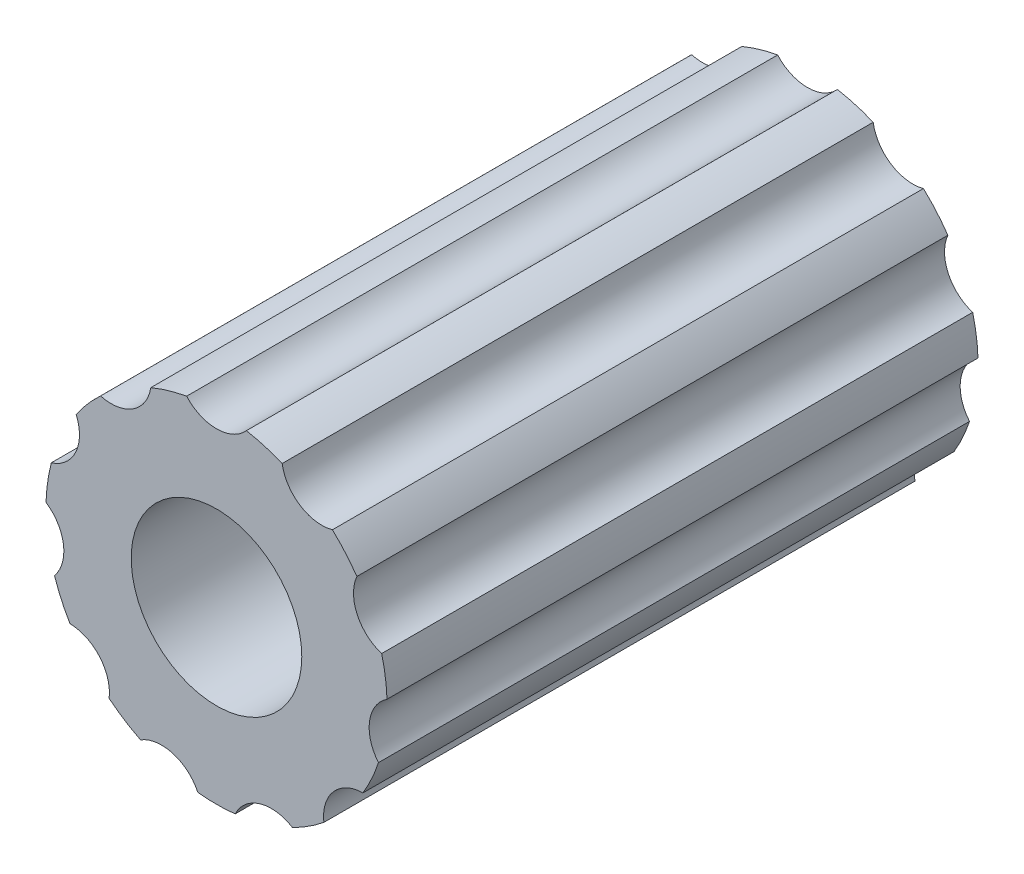
ISO-10303-21;
HEADER;
FILE_DESCRIPTION(('STEP AP214'),'2;1');
FILE_NAME('part.step','',(''),(''),'','','');
FILE_SCHEMA(('AUTOMOTIVE_DESIGN { 1 0 10303 214 1 1 1 1 }'));
ENDSEC;
DATA;
#1=APPLICATION_CONTEXT('core data for automotive mechanical design processes');
#2=APPLICATION_PROTOCOL_DEFINITION('international standard','automotive_design',2000,#1);
#3=PRODUCT_CONTEXT('',#1,'mechanical');
#4=PRODUCT('Part','Part','',(#3));
#5=PRODUCT_RELATED_PRODUCT_CATEGORY('part','',(#4));
#6=PRODUCT_DEFINITION_FORMATION('','',#4);
#7=PRODUCT_DEFINITION_CONTEXT('part definition',#1,'design');
#8=PRODUCT_DEFINITION('design','',#6,#7);
#9=PRODUCT_DEFINITION_SHAPE('','',#8);
#10=(LENGTH_UNIT() NAMED_UNIT(*) SI_UNIT(.MILLI.,.METRE.));
#11=(NAMED_UNIT(*) PLANE_ANGLE_UNIT() SI_UNIT($,.RADIAN.));
#12=(NAMED_UNIT(*) SI_UNIT($,.STERADIAN.) SOLID_ANGLE_UNIT());
#13=UNCERTAINTY_MEASURE_WITH_UNIT(LENGTH_MEASURE(1.E-05),#10,'distance_accuracy_value','');
#14=(GEOMETRIC_REPRESENTATION_CONTEXT(3) GLOBAL_UNCERTAINTY_ASSIGNED_CONTEXT((#13)) GLOBAL_UNIT_ASSIGNED_CONTEXT((#10,
#11,#12)) REPRESENTATION_CONTEXT('',''));
#15=CARTESIAN_POINT('',(0.,0.,0.));
#16=DIRECTION('',(0.,0.,1.));
#17=DIRECTION('',(1.,0.,0.));
#18=AXIS2_PLACEMENT_3D('',#15,#16,#17);
#19=CARTESIAN_POINT('',(0.,0.,22.));
#20=DIRECTION('',(0.,0.,-1.));
#21=DIRECTION('',(-1.,0.,0.));
#22=AXIS2_PLACEMENT_3D('',#19,#20,#21);
#23=CYLINDRICAL_SURFACE('',#22,6.35);
#24=CARTESIAN_POINT('',(0.,0.,0.));
#25=DIRECTION('',(0.,0.,1.));
#26=DIRECTION('',(1.,0.,0.));
#27=AXIS2_PLACEMENT_3D('',#24,#25,#26);
#28=CIRCLE('',#27,6.35);
#29=CARTESIAN_POINT('',(5.22515986860669,3.60835202654925,0.));
#30=VERTEX_POINT('',#29);
#31=CARTESIAN_POINT('',(4.31524198738567,4.65845324011133,0.));
#32=VERTEX_POINT('',#31);
#33=EDGE_CURVE('E244',#30,#32,#28,.T.);
#34=ORIENTED_EDGE('',*,*,#33,.T.);
#35=DIRECTION('',(0.,0.,1.));
#36=VECTOR('',#35,1.);
#37=CARTESIAN_POINT('',(4.31524198738567,4.65845324011133,0.));
#38=LINE('',#37,#36);
#39=CARTESIAN_POINT('',(4.31524198738567,4.65845324011133,22.));
#40=VERTEX_POINT('',#39);
#41=EDGE_CURVE('E52',#32,#40,#38,.T.);
#42=ORIENTED_EDGE('',*,*,#41,.T.);
#43=CARTESIAN_POINT('',(0.,0.,22.));
#44=DIRECTION('',(0.,0.,1.));
#45=DIRECTION('',(1.,0.,0.));
#46=AXIS2_PLACEMENT_3D('',#43,#44,#45);
#47=CIRCLE('',#46,6.35);
#48=CARTESIAN_POINT('',(5.22515986860669,3.60835202654925,22.));
#49=VERTEX_POINT('',#48);
#50=EDGE_CURVE('E265',#49,#40,#47,.T.);
#51=ORIENTED_EDGE('',*,*,#50,.F.);
#52=DIRECTION('',(0.,0.,1.));
#53=VECTOR('',#52,1.);
#54=CARTESIAN_POINT('',(5.22515986860669,3.60835202654925,0.));
#55=LINE('',#54,#53);
#56=EDGE_CURVE('E298',#30,#49,#55,.T.);
#57=ORIENTED_EDGE('',*,*,#56,.F.);
#58=EDGE_LOOP('',(#34,#42,#51,#57));
#59=FACE_BOUND('',#58,.T.);
#60=ADVANCED_FACE('F35',(#59),#23,.T.);
#61=CARTESIAN_POINT('',(6.34650658837424,0.210604187333398,0.));
#62=VERTEX_POINT('',#61);
#63=CARTESIAN_POINT('',(6.14876253472211,1.58594429019361,0.));
#64=VERTEX_POINT('',#63);
#65=EDGE_CURVE('E238',#62,#64,#28,.T.);
#66=ORIENTED_EDGE('',*,*,#65,.T.);
#67=DIRECTION('',(0.,0.,1.));
#68=VECTOR('',#67,1.);
#69=CARTESIAN_POINT('',(6.14876253472211,1.58594429019361,0.));
#70=LINE('',#69,#68);
#71=CARTESIAN_POINT('',(6.14876253472211,1.58594429019361,22.));
#72=VERTEX_POINT('',#71);
#73=EDGE_CURVE('E60',#64,#72,#70,.T.);
#74=ORIENTED_EDGE('',*,*,#73,.T.);
#75=CARTESIAN_POINT('',(6.34650658837424,0.210604187333398,22.));
#76=VERTEX_POINT('',#75);
#77=EDGE_CURVE('E272',#76,#72,#47,.T.);
#78=ORIENTED_EDGE('',*,*,#77,.F.);
#79=DIRECTION('',(0.,0.,1.));
#80=VECTOR('',#79,1.);
#81=CARTESIAN_POINT('',(6.34650658837424,0.210604187333398,0.));
#82=LINE('',#81,#80);
#83=EDGE_CURVE('E305',#62,#76,#82,.T.);
#84=ORIENTED_EDGE('',*,*,#83,.F.);
#85=EDGE_LOOP('',(#66,#74,#78,#84));
#86=FACE_BOUND('',#85,.T.);
#87=ADVANCED_FACE('F428',(#86),#23,.T.);
#88=CARTESIAN_POINT('',(5.45288230860569,-3.25400899330273,0.));
#89=VERTEX_POINT('',#88);
#90=CARTESIAN_POINT('',(6.03009442236429,-1.99009076611372,0.));
#91=VERTEX_POINT('',#90);
#92=EDGE_CURVE('E232',#89,#91,#28,.T.);
#93=ORIENTED_EDGE('',*,*,#92,.T.);
#94=DIRECTION('',(0.,0.,1.));
#95=VECTOR('',#94,1.);
#96=CARTESIAN_POINT('',(6.03009442236429,-1.99009076611371,0.));
#97=LINE('',#96,#95);
#98=CARTESIAN_POINT('',(6.03009442236429,-1.99009076611371,22.));
#99=VERTEX_POINT('',#98);
#100=EDGE_CURVE('E307',#91,#99,#97,.T.);
#101=ORIENTED_EDGE('',*,*,#100,.T.);
#102=CARTESIAN_POINT('',(5.45288230860569,-3.25400899330273,22.));
#103=VERTEX_POINT('',#102);
#104=EDGE_CURVE('E420',#103,#99,#47,.T.);
#105=ORIENTED_EDGE('',*,*,#104,.F.);
#106=DIRECTION('',(0.,0.,1.));
#107=VECTOR('',#106,1.);
#108=CARTESIAN_POINT('',(5.45288230860569,-3.25400899330273,0.));
#109=LINE('',#108,#107);
#110=EDGE_CURVE('E314',#89,#103,#109,.T.);
#111=ORIENTED_EDGE('',*,*,#110,.F.);
#112=EDGE_LOOP('',(#93,#101,#105,#111));
#113=FACE_BOUND('',#112,.T.);
#114=ADVANCED_FACE('F435',(#113),#23,.T.);
#115=CARTESIAN_POINT('',(2.82800642408012,-5.68549731029411,0.));
#116=VERTEX_POINT('',#115);
#117=CARTESIAN_POINT('',(3.996913937517,-4.93428606548935,0.));
#118=VERTEX_POINT('',#117);
#119=EDGE_CURVE('E226',#116,#118,#28,.T.);
#120=ORIENTED_EDGE('',*,*,#119,.T.);
#121=DIRECTION('',(0.,0.,1.));
#122=VECTOR('',#121,1.);
#123=CARTESIAN_POINT('',(3.996913937517,-4.93428606548935,0.));
#124=LINE('',#123,#122);
#125=CARTESIAN_POINT('',(3.996913937517,-4.93428606548935,22.));
#126=VERTEX_POINT('',#125);
#127=EDGE_CURVE('E316',#118,#126,#124,.T.);
#128=ORIENTED_EDGE('',*,*,#127,.T.);
#129=CARTESIAN_POINT('',(2.82800642408012,-5.68549731029411,22.));
#130=VERTEX_POINT('',#129);
#131=EDGE_CURVE('E416',#130,#126,#47,.T.);
#132=ORIENTED_EDGE('',*,*,#131,.F.);
#133=DIRECTION('',(0.,0.,1.));
#134=VECTOR('',#133,1.);
#135=CARTESIAN_POINT('',(2.82800642408012,-5.68549731029411,0.));
#136=LINE('',#135,#134);
#137=EDGE_CURVE('E323',#116,#130,#136,.T.);
#138=ORIENTED_EDGE('',*,*,#137,.F.);
#139=EDGE_LOOP('',(#120,#128,#132,#138));
#140=FACE_BOUND('',#139,.T.);
#141=ADVANCED_FACE('F460',(#140),#23,.T.);
#142=CARTESIAN_POINT('',(-0.694741518352336,-6.31188040307146,0.));
#143=VERTEX_POINT('',#142);
#144=CARTESIAN_POINT('',(0.694741518352425,-6.31188040307145,0.));
#145=VERTEX_POINT('',#144);
#146=EDGE_CURVE('E220',#143,#145,#28,.T.);
#147=ORIENTED_EDGE('',*,*,#146,.T.);
#148=DIRECTION('',(0.,0.,1.));
#149=VECTOR('',#148,1.);
#150=CARTESIAN_POINT('',(0.694741518352428,-6.31188040307145,0.));
#151=LINE('',#150,#149);
#152=CARTESIAN_POINT('',(0.694741518352428,-6.31188040307145,22.));
#153=VERTEX_POINT('',#152);
#154=EDGE_CURVE('E325',#145,#153,#151,.T.);
#155=ORIENTED_EDGE('',*,*,#154,.T.);
#156=CARTESIAN_POINT('',(-0.694741518352336,-6.31188040307146,22.));
#157=VERTEX_POINT('',#156);
#158=EDGE_CURVE('E412',#157,#153,#47,.T.);
#159=ORIENTED_EDGE('',*,*,#158,.F.);
#160=DIRECTION('',(0.,0.,1.));
#161=VECTOR('',#160,1.);
#162=CARTESIAN_POINT('',(-0.694741518352336,-6.31188040307146,0.));
#163=LINE('',#162,#161);
#164=EDGE_CURVE('E332',#143,#157,#163,.T.);
#165=ORIENTED_EDGE('',*,*,#164,.F.);
#166=EDGE_LOOP('',(#147,#155,#159,#165));
#167=FACE_BOUND('',#166,.T.);
#168=ADVANCED_FACE('F456',(#167),#23,.T.);
#169=CARTESIAN_POINT('',(-3.99691393751693,-4.93428606548941,0.));
#170=VERTEX_POINT('',#169);
#171=CARTESIAN_POINT('',(-2.82800642408004,-5.68549731029415,0.));
#172=VERTEX_POINT('',#171);
#173=EDGE_CURVE('E215',#170,#172,#28,.T.);
#174=ORIENTED_EDGE('',*,*,#173,.T.);
#175=DIRECTION('',(0.,0.,1.));
#176=VECTOR('',#175,1.);
#177=CARTESIAN_POINT('',(-2.82800642408004,-5.68549731029415,0.));
#178=LINE('',#177,#176);
#179=CARTESIAN_POINT('',(-2.82800642408004,-5.68549731029415,22.));
#180=VERTEX_POINT('',#179);
#181=EDGE_CURVE('E334',#172,#180,#178,.T.);
#182=ORIENTED_EDGE('',*,*,#181,.T.);
#183=CARTESIAN_POINT('',(-3.99691393751693,-4.93428606548941,22.));
#184=VERTEX_POINT('',#183);
#185=EDGE_CURVE('E408',#184,#180,#47,.T.);
#186=ORIENTED_EDGE('',*,*,#185,.F.);
#187=DIRECTION('',(0.,0.,1.));
#188=VECTOR('',#187,1.);
#189=CARTESIAN_POINT('',(-3.99691393751693,-4.93428606548941,0.));
#190=LINE('',#189,#188);
#191=EDGE_CURVE('E341',#170,#184,#190,.T.);
#192=ORIENTED_EDGE('',*,*,#191,.F.);
#193=EDGE_LOOP('',(#174,#182,#186,#192));
#194=FACE_BOUND('',#193,.T.);
#195=ADVANCED_FACE('F452',(#194),#23,.T.);
#196=CARTESIAN_POINT('',(-6.03009442236426,-1.9900907661138,0.));
#197=VERTEX_POINT('',#196);
#198=CARTESIAN_POINT('',(-5.45288230860565,-3.25400899330281,0.));
#199=VERTEX_POINT('',#198);
#200=EDGE_CURVE('E213',#197,#199,#28,.T.);
#201=ORIENTED_EDGE('',*,*,#200,.T.);
#202=DIRECTION('',(0.,0.,1.));
#203=VECTOR('',#202,1.);
#204=CARTESIAN_POINT('',(-5.45288230860564,-3.25400899330281,0.));
#205=LINE('',#204,#203);
#206=CARTESIAN_POINT('',(-5.45288230860564,-3.25400899330281,22.));
#207=VERTEX_POINT('',#206);
#208=EDGE_CURVE('E343',#199,#207,#205,.T.);
#209=ORIENTED_EDGE('',*,*,#208,.T.);
#210=CARTESIAN_POINT('',(-6.03009442236426,-1.9900907661138,22.));
#211=VERTEX_POINT('',#210);
#212=EDGE_CURVE('E405',#211,#207,#47,.T.);
#213=ORIENTED_EDGE('',*,*,#212,.F.);
#214=DIRECTION('',(0.,0.,1.));
#215=VECTOR('',#214,1.);
#216=CARTESIAN_POINT('',(-6.03009442236426,-1.9900907661138,0.));
#217=LINE('',#216,#215);
#218=EDGE_CURVE('E350',#197,#211,#217,.T.);
#219=ORIENTED_EDGE('',*,*,#218,.F.);
#220=EDGE_LOOP('',(#201,#209,#213,#219));
#221=FACE_BOUND('',#220,.T.);
#222=ADVANCED_FACE('F448',(#221),#23,.T.);
#223=CARTESIAN_POINT('',(-6.14876253472214,1.58594429019352,0.));
#224=VERTEX_POINT('',#223);
#225=CARTESIAN_POINT('',(-6.34650658837424,0.21060418733331,0.));
#226=VERTEX_POINT('',#225);
#227=EDGE_CURVE('E203',#224,#226,#28,.T.);
#228=ORIENTED_EDGE('',*,*,#227,.T.);
#229=DIRECTION('',(0.,0.,1.));
#230=VECTOR('',#229,1.);
#231=CARTESIAN_POINT('',(-6.34650658837424,0.210604187333307,0.));
#232=LINE('',#231,#230);
#233=CARTESIAN_POINT('',(-6.34650658837424,0.210604187333307,22.));
#234=VERTEX_POINT('',#233);
#235=EDGE_CURVE('E352',#226,#234,#232,.T.);
#236=ORIENTED_EDGE('',*,*,#235,.T.);
#237=CARTESIAN_POINT('',(-6.14876253472214,1.58594429019352,22.));
#238=VERTEX_POINT('',#237);
#239=EDGE_CURVE('E205',#238,#234,#47,.T.);
#240=ORIENTED_EDGE('',*,*,#239,.F.);
#241=DIRECTION('',(0.,0.,1.));
#242=VECTOR('',#241,1.);
#243=CARTESIAN_POINT('',(-6.14876253472214,1.58594429019352,0.));
#244=LINE('',#243,#242);
#245=EDGE_CURVE('E188',#224,#238,#244,.T.);
#246=ORIENTED_EDGE('',*,*,#245,.F.);
#247=EDGE_LOOP('',(#228,#236,#240,#246));
#248=FACE_BOUND('',#247,.T.);
#249=ADVANCED_FACE('F201',(#248),#23,.T.);
#250=CARTESIAN_POINT('',(-4.31524198738574,4.65845324011127,0.));
#251=VERTEX_POINT('',#250);
#252=CARTESIAN_POINT('',(-5.22515986860674,3.60835202654918,0.));
#253=VERTEX_POINT('',#252);
#254=EDGE_CURVE('E212',#251,#253,#28,.T.);
#255=ORIENTED_EDGE('',*,*,#254,.T.);
#256=DIRECTION('',(0.,0.,1.));
#257=VECTOR('',#256,1.);
#258=CARTESIAN_POINT('',(-5.22515986860674,3.60835202654918,0.));
#259=LINE('',#258,#257);
#260=CARTESIAN_POINT('',(-5.22515986860674,3.60835202654918,22.));
#261=VERTEX_POINT('',#260);
#262=EDGE_CURVE('E191',#253,#261,#259,.T.);
#263=ORIENTED_EDGE('',*,*,#262,.T.);
#264=CARTESIAN_POINT('',(-4.31524198738574,4.65845324011127,22.));
#265=VERTEX_POINT('',#264);
#266=EDGE_CURVE('E44',#265,#261,#47,.T.);
#267=ORIENTED_EDGE('',*,*,#266,.F.);
#268=DIRECTION('',(0.,0.,1.));
#269=VECTOR('',#268,1.);
#270=CARTESIAN_POINT('',(-4.31524198738574,4.65845324011127,0.));
#271=LINE('',#270,#269);
#272=EDGE_CURVE('E281',#251,#265,#271,.T.);
#273=ORIENTED_EDGE('',*,*,#272,.F.);
#274=EDGE_LOOP('',(#255,#263,#267,#273));
#275=FACE_BOUND('',#274,.T.);
#276=ADVANCED_FACE('F403',(#275),#23,.T.);
#277=CARTESIAN_POINT('',(-1.11166259909726,6.25193620135141,0.));
#278=VERTEX_POINT('',#277);
#279=CARTESIAN_POINT('',(-2.44486180977202,5.86047359273278,0.));
#280=VERTEX_POINT('',#279);
#281=EDGE_CURVE('E39',#278,#280,#28,.T.);
#282=ORIENTED_EDGE('',*,*,#281,.T.);
#283=DIRECTION('',(0.,0.,1.));
#284=VECTOR('',#283,1.);
#285=CARTESIAN_POINT('',(-2.44486180977202,5.86047359273278,0.));
#286=LINE('',#285,#284);
#287=CARTESIAN_POINT('',(-2.44486180977202,5.86047359273278,22.));
#288=VERTEX_POINT('',#287);
#289=EDGE_CURVE('E278',#280,#288,#286,.T.);
#290=ORIENTED_EDGE('',*,*,#289,.T.);
#291=CARTESIAN_POINT('',(-1.11166259909726,6.25193620135141,22.));
#292=VERTEX_POINT('',#291);
#293=EDGE_CURVE('E12',#292,#288,#47,.T.);
#294=ORIENTED_EDGE('',*,*,#293,.F.);
#295=DIRECTION('',(0.,0.,1.));
#296=VECTOR('',#295,1.);
#297=CARTESIAN_POINT('',(-1.11166259909726,6.25193620135141,0.));
#298=LINE('',#297,#296);
#299=EDGE_CURVE('E258',#278,#292,#298,.T.);
#300=ORIENTED_EDGE('',*,*,#299,.F.);
#301=EDGE_LOOP('',(#282,#290,#294,#300));
#302=FACE_BOUND('',#301,.T.);
#303=ADVANCED_FACE('F437',(#302),#23,.T.);
#304=CARTESIAN_POINT('',(2.44486180977193,5.86047359273282,22.));
#305=VERTEX_POINT('',#304);
#306=CARTESIAN_POINT('',(1.11166259909726,6.25193620135141,22.));
#307=VERTEX_POINT('',#306);
#308=EDGE_CURVE('E45',#305,#307,#47,.T.);
#309=ORIENTED_EDGE('',*,*,#308,.F.);
#310=DIRECTION('',(0.,0.,1.));
#311=VECTOR('',#310,1.);
#312=CARTESIAN_POINT('',(2.44486180977193,5.86047359273282,0.));
#313=LINE('',#312,#311);
#314=CARTESIAN_POINT('',(2.44486180977193,5.86047359273282,0.));
#315=VERTEX_POINT('',#314);
#316=EDGE_CURVE('E289',#315,#305,#313,.T.);
#317=ORIENTED_EDGE('',*,*,#316,.F.);
#318=CARTESIAN_POINT('',(1.11166259909726,6.25193620135141,0.));
#319=VERTEX_POINT('',#318);
#320=EDGE_CURVE('E249',#315,#319,#28,.T.);
#321=ORIENTED_EDGE('',*,*,#320,.T.);
#322=DIRECTION('',(0.,0.,1.));
#323=VECTOR('',#322,1.);
#324=CARTESIAN_POINT('',(1.11166259909726,6.25193620135141,0.));
#325=LINE('',#324,#323);
#326=EDGE_CURVE('E253',#319,#307,#325,.T.);
#327=ORIENTED_EDGE('',*,*,#326,.T.);
#328=EDGE_LOOP('',(#309,#317,#321,#327));
#329=FACE_BOUND('',#328,.T.);
#330=ADVANCED_FACE('F37',(#329),#23,.T.);
#331=CARTESIAN_POINT('',(0.,0.,22.));
#332=DIRECTION('',(0.,0.,1.));
#333=DIRECTION('',(1.,0.,0.));
#334=AXIS2_PLACEMENT_3D('',#331,#332,#333);
#335=PLANE('',#334);
#336=CARTESIAN_POINT('',(0.,0.,22.));
#337=DIRECTION('',(0.,0.,1.));
#338=DIRECTION('',(1.,0.,0.));
#339=AXIS2_PLACEMENT_3D('',#336,#337,#338);
#340=CIRCLE('',#339,3.175);
#341=CARTESIAN_POINT('',(3.175,0.,22.));
#342=VERTEX_POINT('',#341);
#343=EDGE_CURVE('E360',#342,#342,#340,.T.);
#344=ORIENTED_EDGE('',*,*,#343,.F.);
#345=EDGE_LOOP('',(#344));
#346=FACE_BOUND('',#345,.T.);
#347=CARTESIAN_POINT('',(3.91872585256887,6.09765644996142,22.));
#348=DIRECTION('',(0.,0.,1.));
#349=DIRECTION('',(0.841253532831189,-0.540640817455586,0.));
#350=AXIS2_PLACEMENT_3D('',#347,#348,#349);
#351=CIRCLE('',#350,1.4928264883813);
#352=EDGE_CURVE('E294',#305,#40,#351,.T.);
#353=ORIENTED_EDGE('',*,*,#352,.F.);
#354=ORIENTED_EDGE('',*,*,#308,.T.);
#355=CARTESIAN_POINT('',(0.,7.2482981788381,22.));
#356=DIRECTION('',(0.,0.,1.));
#357=DIRECTION('',(1.,0.,0.));
#358=AXIS2_PLACEMENT_3D('',#355,#356,#357);
#359=CIRCLE('',#358,1.4928264883813);
#360=EDGE_CURVE('E276',#292,#307,#359,.T.);
#361=ORIENTED_EDGE('',*,*,#360,.F.);
#362=ORIENTED_EDGE('',*,*,#293,.T.);
#363=CARTESIAN_POINT('',(-3.91872585256896,6.09765644996136,22.));
#364=DIRECTION('',(0.,0.,1.));
#365=DIRECTION('',(0.841253532831181,0.540640817455599,0.));
#366=AXIS2_PLACEMENT_3D('',#363,#364,#365);
#367=CIRCLE('',#366,1.4928264883813);
#368=EDGE_CURVE('E285',#265,#288,#367,.T.);
#369=ORIENTED_EDGE('',*,*,#368,.F.);
#370=ORIENTED_EDGE('',*,*,#266,.T.);
#371=CARTESIAN_POINT('',(-6.59328393534103,3.01105188220356,22.));
#372=DIRECTION('',(0.,0.,1.));
#373=DIRECTION('',(0.415415013001884,0.909631995354519,0.));
#374=AXIS2_PLACEMENT_3D('',#371,#372,#373);
#375=CIRCLE('',#374,1.4928264883813);
#376=EDGE_CURVE('E196',#238,#261,#375,.T.);
#377=ORIENTED_EDGE('',*,*,#376,.F.);
#378=ORIENTED_EDGE('',*,*,#239,.T.);
#379=CARTESIAN_POINT('',(-7.17452095456046,-1.03154038307792,22.));
#380=DIRECTION('',(0.,0.,1.));
#381=DIRECTION('',(-0.142314838273289,0.989821441880932,0.));
#382=AXIS2_PLACEMENT_3D('',#379,#380,#381);
#383=CIRCLE('',#382,1.4928264883813);
#384=EDGE_CURVE('E346',#211,#234,#383,.T.);
#385=ORIENTED_EDGE('',*,*,#384,.F.);
#386=ORIENTED_EDGE('',*,*,#212,.T.);
#387=CARTESIAN_POINT('',(-5.47789826344961,-4.74662586524822,22.));
#388=DIRECTION('',(0.,0.,1.));
#389=DIRECTION('',(-0.654860733945289,0.755749574354255,0.));
#390=AXIS2_PLACEMENT_3D('',#387,#388,#389);
#391=CIRCLE('',#390,1.4928264883813);
#392=EDGE_CURVE('E337',#184,#207,#391,.T.);
#393=ORIENTED_EDGE('',*,*,#392,.F.);
#394=ORIENTED_EDGE('',*,*,#185,.T.);
#395=CARTESIAN_POINT('',(-2.04208157867309,-6.95469117325793,22.));
#396=DIRECTION('',(0.,0.,1.));
#397=DIRECTION('',(-0.959492973614499,0.281732556841423,0.));
#398=AXIS2_PLACEMENT_3D('',#395,#396,#397);
#399=CIRCLE('',#398,1.4928264883813);
#400=EDGE_CURVE('E328',#157,#180,#399,.T.);
#401=ORIENTED_EDGE('',*,*,#400,.F.);
#402=ORIENTED_EDGE('',*,*,#158,.T.);
#403=CARTESIAN_POINT('',(2.04208157867319,-6.9546911732579,22.));
#404=DIRECTION('',(0.,0.,1.));
#405=DIRECTION('',(-0.959492973614495,-0.281732556841437,0.));
#406=AXIS2_PLACEMENT_3D('',#403,#404,#405);
#407=CIRCLE('',#406,1.4928264883813);
#408=EDGE_CURVE('E319',#130,#153,#407,.T.);
#409=ORIENTED_EDGE('',*,*,#408,.F.);
#410=ORIENTED_EDGE('',*,*,#131,.T.);
#411=CARTESIAN_POINT('',(5.47789826344968,-4.74662586524814,22.));
#412=DIRECTION('',(0.,0.,1.));
#413=DIRECTION('',(-0.654860733945278,-0.755749574354264,0.));
#414=AXIS2_PLACEMENT_3D('',#411,#412,#413);
#415=CIRCLE('',#414,1.4928264883813);
#416=EDGE_CURVE('E310',#103,#126,#415,.T.);
#417=ORIENTED_EDGE('',*,*,#416,.F.);
#418=ORIENTED_EDGE('',*,*,#104,.T.);
#419=CARTESIAN_POINT('',(7.17452095456048,-1.03154038307782,22.));
#420=DIRECTION('',(0.,0.,1.));
#421=DIRECTION('',(-0.142314838273275,-0.989821441880934,0.));
#422=AXIS2_PLACEMENT_3D('',#419,#420,#421);
#423=CIRCLE('',#422,1.4928264883813);
#424=EDGE_CURVE('E302',#76,#99,#423,.T.);
#425=ORIENTED_EDGE('',*,*,#424,.F.);
#426=ORIENTED_EDGE('',*,*,#77,.T.);
#427=CARTESIAN_POINT('',(6.59328393534099,3.01105188220366,22.));
#428=DIRECTION('',(0.,0.,1.));
#429=DIRECTION('',(0.415415013001897,-0.909631995354513,0.));
#430=AXIS2_PLACEMENT_3D('',#427,#428,#429);
#431=CIRCLE('',#430,1.4928264883813);
#432=EDGE_CURVE('E293',#49,#72,#431,.T.);
#433=ORIENTED_EDGE('',*,*,#432,.F.);
#434=ORIENTED_EDGE('',*,*,#50,.T.);
#435=EDGE_LOOP('',(#353,#354,#361,#362,#369,#370,#377,#378,#385,#386,#393,#394,#401,#402,#409,
#410,#417,#418,#425,#426,#433,#434));
#436=FACE_BOUND('',#435,.T.);
#437=ADVANCED_FACE('F390',(#346,#436),#335,.T.);
#438=CARTESIAN_POINT('',(0.,0.,0.));
#439=DIRECTION('',(0.,0.,1.));
#440=DIRECTION('',(1.,0.,0.));
#441=AXIS2_PLACEMENT_3D('',#438,#439,#440);
#442=PLANE('',#441);
#443=CARTESIAN_POINT('',(0.,0.,0.));
#444=DIRECTION('',(0.,0.,1.));
#445=DIRECTION('',(1.,0.,0.));
#446=AXIS2_PLACEMENT_3D('',#443,#444,#445);
#447=CIRCLE('',#446,0.9525);
#448=CARTESIAN_POINT('',(0.9525,0.,0.));
#449=VERTEX_POINT('',#448);
#450=EDGE_CURVE('E363',#449,#449,#447,.T.);
#451=ORIENTED_EDGE('',*,*,#450,.T.);
#452=EDGE_LOOP('',(#451));
#453=FACE_BOUND('',#452,.T.);
#454=ORIENTED_EDGE('',*,*,#320,.F.);
#455=CARTESIAN_POINT('',(3.91872585256887,6.09765644996142,0.));
#456=DIRECTION('',(0.,0.,1.));
#457=DIRECTION('',(0.841253532831189,-0.540640817455586,0.));
#458=AXIS2_PLACEMENT_3D('',#455,#456,#457);
#459=CIRCLE('',#458,1.4928264883813);
#460=EDGE_CURVE('E291',#315,#32,#459,.T.);
#461=ORIENTED_EDGE('',*,*,#460,.T.);
#462=ORIENTED_EDGE('',*,*,#33,.F.);
#463=CARTESIAN_POINT('',(6.59328393534099,3.01105188220366,0.));
#464=DIRECTION('',(0.,0.,1.));
#465=DIRECTION('',(0.415415013001897,-0.909631995354513,0.));
#466=AXIS2_PLACEMENT_3D('',#463,#464,#465);
#467=CIRCLE('',#466,1.4928264883813);
#468=EDGE_CURVE('E300',#30,#64,#467,.T.);
#469=ORIENTED_EDGE('',*,*,#468,.T.);
#470=ORIENTED_EDGE('',*,*,#65,.F.);
#471=CARTESIAN_POINT('',(7.17452095456048,-1.03154038307782,0.));
#472=DIRECTION('',(0.,0.,1.));
#473=DIRECTION('',(-0.142314838273275,-0.989821441880934,0.));
#474=AXIS2_PLACEMENT_3D('',#471,#472,#473);
#475=CIRCLE('',#474,1.4928264883813);
#476=EDGE_CURVE('E308',#62,#91,#475,.T.);
#477=ORIENTED_EDGE('',*,*,#476,.T.);
#478=ORIENTED_EDGE('',*,*,#92,.F.);
#479=CARTESIAN_POINT('',(5.47789826344968,-4.74662586524814,0.));
#480=DIRECTION('',(0.,0.,1.));
#481=DIRECTION('',(-0.654860733945278,-0.755749574354264,0.));
#482=AXIS2_PLACEMENT_3D('',#479,#480,#481);
#483=CIRCLE('',#482,1.4928264883813);
#484=EDGE_CURVE('E317',#89,#118,#483,.T.);
#485=ORIENTED_EDGE('',*,*,#484,.T.);
#486=ORIENTED_EDGE('',*,*,#119,.F.);
#487=CARTESIAN_POINT('',(2.04208157867319,-6.9546911732579,0.));
#488=DIRECTION('',(0.,0.,1.));
#489=DIRECTION('',(-0.959492973614495,-0.281732556841437,0.));
#490=AXIS2_PLACEMENT_3D('',#487,#488,#489);
#491=CIRCLE('',#490,1.4928264883813);
#492=EDGE_CURVE('E326',#116,#145,#491,.T.);
#493=ORIENTED_EDGE('',*,*,#492,.T.);
#494=ORIENTED_EDGE('',*,*,#146,.F.);
#495=CARTESIAN_POINT('',(-2.04208157867309,-6.95469117325793,0.));
#496=DIRECTION('',(0.,0.,1.));
#497=DIRECTION('',(-0.959492973614499,0.281732556841423,0.));
#498=AXIS2_PLACEMENT_3D('',#495,#496,#497);
#499=CIRCLE('',#498,1.4928264883813);
#500=EDGE_CURVE('E335',#143,#172,#499,.T.);
#501=ORIENTED_EDGE('',*,*,#500,.T.);
#502=ORIENTED_EDGE('',*,*,#173,.F.);
#503=CARTESIAN_POINT('',(-5.47789826344961,-4.74662586524822,0.));
#504=DIRECTION('',(0.,0.,1.));
#505=DIRECTION('',(-0.654860733945289,0.755749574354255,0.));
#506=AXIS2_PLACEMENT_3D('',#503,#504,#505);
#507=CIRCLE('',#506,1.4928264883813);
#508=EDGE_CURVE('E344',#170,#199,#507,.T.);
#509=ORIENTED_EDGE('',*,*,#508,.T.);
#510=ORIENTED_EDGE('',*,*,#200,.F.);
#511=CARTESIAN_POINT('',(-7.17452095456046,-1.03154038307792,0.));
#512=DIRECTION('',(0.,0.,1.));
#513=DIRECTION('',(-0.142314838273289,0.989821441880932,0.));
#514=AXIS2_PLACEMENT_3D('',#511,#512,#513);
#515=CIRCLE('',#514,1.4928264883813);
#516=EDGE_CURVE('E211',#197,#226,#515,.T.);
#517=ORIENTED_EDGE('',*,*,#516,.T.);
#518=ORIENTED_EDGE('',*,*,#227,.F.);
#519=CARTESIAN_POINT('',(-6.59328393534103,3.01105188220356,0.));
#520=DIRECTION('',(0.,0.,1.));
#521=DIRECTION('',(0.415415013001884,0.909631995354519,0.));
#522=AXIS2_PLACEMENT_3D('',#519,#520,#521);
#523=CIRCLE('',#522,1.4928264883813);
#524=EDGE_CURVE('E185',#224,#253,#523,.T.);
#525=ORIENTED_EDGE('',*,*,#524,.T.);
#526=ORIENTED_EDGE('',*,*,#254,.F.);
#527=CARTESIAN_POINT('',(-3.91872585256896,6.09765644996136,0.));
#528=DIRECTION('',(0.,0.,1.));
#529=DIRECTION('',(0.841253532831181,0.540640817455599,0.));
#530=AXIS2_PLACEMENT_3D('',#527,#528,#529);
#531=CIRCLE('',#530,1.4928264883813);
#532=EDGE_CURVE('E283',#251,#280,#531,.T.);
#533=ORIENTED_EDGE('',*,*,#532,.T.);
#534=ORIENTED_EDGE('',*,*,#281,.F.);
#535=CARTESIAN_POINT('',(0.,7.2482981788381,0.));
#536=DIRECTION('',(0.,0.,1.));
#537=DIRECTION('',(1.,0.,0.));
#538=AXIS2_PLACEMENT_3D('',#535,#536,#537);
#539=CIRCLE('',#538,1.4928264883813);
#540=EDGE_CURVE('E274',#278,#319,#539,.T.);
#541=ORIENTED_EDGE('',*,*,#540,.T.);
#542=EDGE_LOOP('',(#454,#461,#462,#469,#470,#477,#478,#485,#486,#493,#494,#501,#502,#509,#510,
#517,#518,#525,#526,#533,#534,#541));
#543=FACE_BOUND('',#542,.T.);
#544=ADVANCED_FACE('F209',(#453,#543),#442,.F.);
#545=CARTESIAN_POINT('',(0.,7.2482981788381,0.));
#546=DIRECTION('',(0.,0.,1.));
#547=DIRECTION('',(1.,0.,0.));
#548=AXIS2_PLACEMENT_3D('',#545,#546,#547);
#549=CYLINDRICAL_SURFACE('',#548,1.4928264883813);
#550=ORIENTED_EDGE('',*,*,#360,.T.);
#551=ORIENTED_EDGE('',*,*,#326,.F.);
#552=ORIENTED_EDGE('',*,*,#540,.F.);
#553=ORIENTED_EDGE('',*,*,#299,.T.);
#554=EDGE_LOOP('',(#550,#551,#552,#553));
#555=FACE_BOUND('',#554,.T.);
#556=ADVANCED_FACE('F396',(#555),#549,.F.);
#557=CARTESIAN_POINT('',(-3.91872585256896,6.09765644996136,0.));
#558=DIRECTION('',(0.,0.,1.));
#559=DIRECTION('',(1.,0.,0.));
#560=AXIS2_PLACEMENT_3D('',#557,#558,#559);
#561=CYLINDRICAL_SURFACE('',#560,1.4928264883813);
#562=ORIENTED_EDGE('',*,*,#368,.T.);
#563=ORIENTED_EDGE('',*,*,#289,.F.);
#564=ORIENTED_EDGE('',*,*,#532,.F.);
#565=ORIENTED_EDGE('',*,*,#272,.T.);
#566=EDGE_LOOP('',(#562,#563,#564,#565));
#567=FACE_BOUND('',#566,.T.);
#568=ADVANCED_FACE('F399',(#567),#561,.F.);
#569=CARTESIAN_POINT('',(-6.59328393534103,3.01105188220356,0.));
#570=DIRECTION('',(0.,0.,1.));
#571=DIRECTION('',(1.,0.,0.));
#572=AXIS2_PLACEMENT_3D('',#569,#570,#571);
#573=CYLINDRICAL_SURFACE('',#572,1.4928264883813);
#574=ORIENTED_EDGE('',*,*,#376,.T.);
#575=ORIENTED_EDGE('',*,*,#262,.F.);
#576=ORIENTED_EDGE('',*,*,#524,.F.);
#577=ORIENTED_EDGE('',*,*,#245,.T.);
#578=EDGE_LOOP('',(#574,#575,#576,#577));
#579=FACE_BOUND('',#578,.T.);
#580=ADVANCED_FACE('F187',(#579),#573,.F.);
#581=CARTESIAN_POINT('',(-7.17452095456046,-1.03154038307792,0.));
#582=DIRECTION('',(0.,0.,1.));
#583=DIRECTION('',(1.,0.,0.));
#584=AXIS2_PLACEMENT_3D('',#581,#582,#583);
#585=CYLINDRICAL_SURFACE('',#584,1.4928264883813);
#586=ORIENTED_EDGE('',*,*,#384,.T.);
#587=ORIENTED_EDGE('',*,*,#235,.F.);
#588=ORIENTED_EDGE('',*,*,#516,.F.);
#589=ORIENTED_EDGE('',*,*,#218,.T.);
#590=EDGE_LOOP('',(#586,#587,#588,#589));
#591=FACE_BOUND('',#590,.T.);
#592=ADVANCED_FACE('F504',(#591),#585,.F.);
#593=CARTESIAN_POINT('',(-5.47789826344961,-4.74662586524822,0.));
#594=DIRECTION('',(0.,0.,1.));
#595=DIRECTION('',(1.,0.,0.));
#596=AXIS2_PLACEMENT_3D('',#593,#594,#595);
#597=CYLINDRICAL_SURFACE('',#596,1.4928264883813);
#598=ORIENTED_EDGE('',*,*,#392,.T.);
#599=ORIENTED_EDGE('',*,*,#208,.F.);
#600=ORIENTED_EDGE('',*,*,#508,.F.);
#601=ORIENTED_EDGE('',*,*,#191,.T.);
#602=EDGE_LOOP('',(#598,#599,#600,#601));
#603=FACE_BOUND('',#602,.T.);
#604=ADVANCED_FACE('F511',(#603),#597,.F.);
#605=CARTESIAN_POINT('',(-2.04208157867309,-6.95469117325793,0.));
#606=DIRECTION('',(0.,0.,1.));
#607=DIRECTION('',(1.,0.,0.));
#608=AXIS2_PLACEMENT_3D('',#605,#606,#607);
#609=CYLINDRICAL_SURFACE('',#608,1.4928264883813);
#610=ORIENTED_EDGE('',*,*,#400,.T.);
#611=ORIENTED_EDGE('',*,*,#181,.F.);
#612=ORIENTED_EDGE('',*,*,#500,.F.);
#613=ORIENTED_EDGE('',*,*,#164,.T.);
#614=EDGE_LOOP('',(#610,#611,#612,#613));
#615=FACE_BOUND('',#614,.T.);
#616=ADVANCED_FACE('F519',(#615),#609,.F.);
#617=CARTESIAN_POINT('',(2.04208157867319,-6.9546911732579,0.));
#618=DIRECTION('',(0.,0.,1.));
#619=DIRECTION('',(1.,0.,0.));
#620=AXIS2_PLACEMENT_3D('',#617,#618,#619);
#621=CYLINDRICAL_SURFACE('',#620,1.4928264883813);
#622=ORIENTED_EDGE('',*,*,#408,.T.);
#623=ORIENTED_EDGE('',*,*,#154,.F.);
#624=ORIENTED_EDGE('',*,*,#492,.F.);
#625=ORIENTED_EDGE('',*,*,#137,.T.);
#626=EDGE_LOOP('',(#622,#623,#624,#625));
#627=FACE_BOUND('',#626,.T.);
#628=ADVANCED_FACE('F527',(#627),#621,.F.);
#629=CARTESIAN_POINT('',(5.47789826344968,-4.74662586524814,0.));
#630=DIRECTION('',(0.,0.,1.));
#631=DIRECTION('',(1.,0.,0.));
#632=AXIS2_PLACEMENT_3D('',#629,#630,#631);
#633=CYLINDRICAL_SURFACE('',#632,1.4928264883813);
#634=ORIENTED_EDGE('',*,*,#416,.T.);
#635=ORIENTED_EDGE('',*,*,#127,.F.);
#636=ORIENTED_EDGE('',*,*,#484,.F.);
#637=ORIENTED_EDGE('',*,*,#110,.T.);
#638=EDGE_LOOP('',(#634,#635,#636,#637));
#639=FACE_BOUND('',#638,.T.);
#640=ADVANCED_FACE('F535',(#639),#633,.F.);
#641=CARTESIAN_POINT('',(7.17452095456048,-1.03154038307782,0.));
#642=DIRECTION('',(0.,0.,1.));
#643=DIRECTION('',(1.,0.,0.));
#644=AXIS2_PLACEMENT_3D('',#641,#642,#643);
#645=CYLINDRICAL_SURFACE('',#644,1.4928264883813);
#646=ORIENTED_EDGE('',*,*,#424,.T.);
#647=ORIENTED_EDGE('',*,*,#100,.F.);
#648=ORIENTED_EDGE('',*,*,#476,.F.);
#649=ORIENTED_EDGE('',*,*,#83,.T.);
#650=EDGE_LOOP('',(#646,#647,#648,#649));
#651=FACE_BOUND('',#650,.T.);
#652=ADVANCED_FACE('F543',(#651),#645,.F.);
#653=CARTESIAN_POINT('',(6.59328393534099,3.01105188220366,0.));
#654=DIRECTION('',(0.,0.,1.));
#655=DIRECTION('',(1.,0.,0.));
#656=AXIS2_PLACEMENT_3D('',#653,#654,#655);
#657=CYLINDRICAL_SURFACE('',#656,1.4928264883813);
#658=ORIENTED_EDGE('',*,*,#432,.T.);
#659=ORIENTED_EDGE('',*,*,#73,.F.);
#660=ORIENTED_EDGE('',*,*,#468,.F.);
#661=ORIENTED_EDGE('',*,*,#56,.T.);
#662=EDGE_LOOP('',(#658,#659,#660,#661));
#663=FACE_BOUND('',#662,.T.);
#664=ADVANCED_FACE('F430',(#663),#657,.F.);
#665=CARTESIAN_POINT('',(3.91872585256887,6.09765644996142,0.));
#666=DIRECTION('',(0.,0.,1.));
#667=DIRECTION('',(1.,0.,0.));
#668=AXIS2_PLACEMENT_3D('',#665,#666,#667);
#669=CYLINDRICAL_SURFACE('',#668,1.4928264883813);
#670=ORIENTED_EDGE('',*,*,#352,.T.);
#671=ORIENTED_EDGE('',*,*,#41,.F.);
#672=ORIENTED_EDGE('',*,*,#460,.F.);
#673=ORIENTED_EDGE('',*,*,#316,.T.);
#674=EDGE_LOOP('',(#670,#671,#672,#673));
#675=FACE_BOUND('',#674,.T.);
#676=ADVANCED_FACE('F386',(#675),#669,.F.);
#677=CARTESIAN_POINT('',(0.,0.,-8.98025612106915));
#678=DIRECTION('',(0.,0.,1.));
#679=DIRECTION('',(1.,0.,0.));
#680=AXIS2_PLACEMENT_3D('',#677,#678,#679);
#681=CYLINDRICAL_SURFACE('',#680,3.175);
#682=CARTESIAN_POINT('',(0.,0.,3.));
#683=DIRECTION('',(0.,0.,1.));
#684=DIRECTION('',(1.,0.,0.));
#685=AXIS2_PLACEMENT_3D('',#682,#683,#684);
#686=CIRCLE('',#685,3.175);
#687=CARTESIAN_POINT('',(3.175,0.,3.));
#688=VERTEX_POINT('',#687);
#689=EDGE_CURVE('E296',#688,#688,#686,.F.);
#690=ORIENTED_EDGE('',*,*,#689,.T.);
#691=EDGE_LOOP('',(#690));
#692=FACE_BOUND('',#691,.T.);
#693=ORIENTED_EDGE('',*,*,#343,.T.);
#694=EDGE_LOOP('',(#693));
#695=FACE_BOUND('',#694,.T.);
#696=ADVANCED_FACE('F380',(#692,#695),#681,.F.);
#697=CARTESIAN_POINT('',(0.,0.,3.));
#698=DIRECTION('',(0.,0.,1.));
#699=DIRECTION('',(1.,0.,0.));
#700=AXIS2_PLACEMENT_3D('',#697,#698,#699);
#701=PLANE('',#700);
#702=CARTESIAN_POINT('',(0.,0.,3.));
#703=DIRECTION('',(0.,0.,1.));
#704=DIRECTION('',(1.,0.,0.));
#705=AXIS2_PLACEMENT_3D('',#702,#703,#704);
#706=CIRCLE('',#705,0.9525);
#707=CARTESIAN_POINT('',(0.9525,0.,3.));
#708=VERTEX_POINT('',#707);
#709=EDGE_CURVE('E364',#708,#708,#706,.T.);
#710=ORIENTED_EDGE('',*,*,#709,.F.);
#711=EDGE_LOOP('',(#710));
#712=FACE_BOUND('',#711,.T.);
#713=ORIENTED_EDGE('',*,*,#689,.F.);
#714=EDGE_LOOP('',(#713));
#715=FACE_BOUND('',#714,.T.);
#716=ADVANCED_FACE('F374',(#712,#715),#701,.T.);
#717=CARTESIAN_POINT('',(0.,0.,0.));
#718=DIRECTION('',(0.,0.,1.));
#719=DIRECTION('',(1.,0.,0.));
#720=AXIS2_PLACEMENT_3D('',#717,#718,#719);
#721=CYLINDRICAL_SURFACE('',#720,0.9525);
#722=ORIENTED_EDGE('',*,*,#450,.F.);
#723=EDGE_LOOP('',(#722));
#724=FACE_BOUND('',#723,.T.);
#725=ORIENTED_EDGE('',*,*,#709,.T.);
#726=EDGE_LOOP('',(#725));
#727=FACE_BOUND('',#726,.T.);
#728=ADVANCED_FACE('F371',(#724,#727),#721,.F.);
#729=CLOSED_SHELL('',(#60,#87,#114,#141,#168,#195,#222,#249,#276,#303,#330,#437,#544,#556,#568,
#580,#592,#604,#616,#628,#640,#652,#664,#676,#696,#716,#728));
#730=MANIFOLD_SOLID_BREP('B2',#729);
#731=ADVANCED_BREP_SHAPE_REPRESENTATION('',(#18,#730),#14);
#732=SHAPE_DEFINITION_REPRESENTATION(#9,#731);
ENDSEC;
END-ISO-10303-21;
